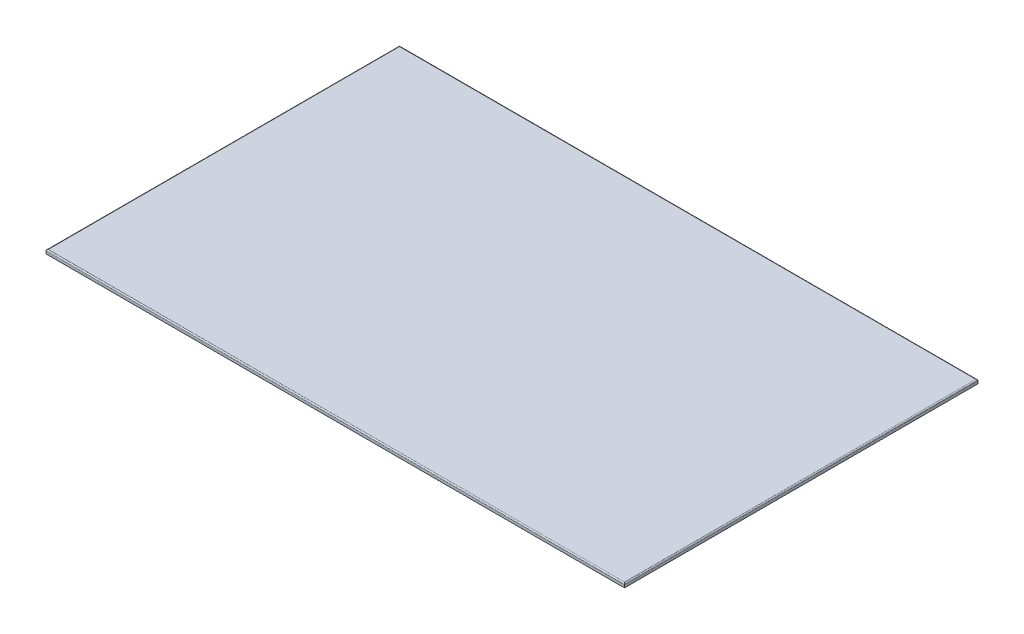
ISO-10303-21;
HEADER;
FILE_DESCRIPTION(('STEP AP214'),'2;1');
FILE_NAME('part.step','',(''),(''),'','','');
FILE_SCHEMA(('AUTOMOTIVE_DESIGN { 1 0 10303 214 1 1 1 1 }'));
ENDSEC;
DATA;
#1=APPLICATION_CONTEXT('core data for automotive mechanical design processes');
#2=APPLICATION_PROTOCOL_DEFINITION('international standard','automotive_design',2000,#1);
#3=PRODUCT_CONTEXT('',#1,'mechanical');
#4=PRODUCT('Part','Part','',(#3));
#5=PRODUCT_RELATED_PRODUCT_CATEGORY('part','',(#4));
#6=PRODUCT_DEFINITION_FORMATION('','',#4);
#7=PRODUCT_DEFINITION_CONTEXT('part definition',#1,'design');
#8=PRODUCT_DEFINITION('design','',#6,#7);
#9=PRODUCT_DEFINITION_SHAPE('','',#8);
#10=(LENGTH_UNIT() NAMED_UNIT(*) SI_UNIT(.MILLI.,.METRE.));
#11=(NAMED_UNIT(*) PLANE_ANGLE_UNIT() SI_UNIT($,.RADIAN.));
#12=(NAMED_UNIT(*) SI_UNIT($,.STERADIAN.) SOLID_ANGLE_UNIT());
#13=UNCERTAINTY_MEASURE_WITH_UNIT(LENGTH_MEASURE(1.E-05),#10,'distance_accuracy_value','');
#14=(GEOMETRIC_REPRESENTATION_CONTEXT(3) GLOBAL_UNCERTAINTY_ASSIGNED_CONTEXT((#13)) GLOBAL_UNIT_ASSIGNED_CONTEXT((#10,
#11,#12)) REPRESENTATION_CONTEXT('',''));
#15=CARTESIAN_POINT('',(0.,0.,0.));
#16=DIRECTION('',(0.,0.,1.));
#17=DIRECTION('',(1.,0.,0.));
#18=AXIS2_PLACEMENT_3D('',#15,#16,#17);
#19=CARTESIAN_POINT('',(450.,6.,275.));
#20=DIRECTION('',(-1.,0.,0.));
#21=DIRECTION('',(0.,0.,1.));
#22=AXIS2_PLACEMENT_3D('',#19,#20,#21);
#23=PLANE('',#22);
#24=DIRECTION('',(0.,-1.,0.));
#25=VECTOR('',#24,1.);
#26=CARTESIAN_POINT('',(450.,6.,-275.));
#27=LINE('',#26,#25);
#28=CARTESIAN_POINT('',(450.,4.25,-275.));
#29=VERTEX_POINT('',#28);
#30=CARTESIAN_POINT('',(450.,0.,-275.));
#31=VERTEX_POINT('',#30);
#32=EDGE_CURVE('E91',#29,#31,#27,.T.);
#33=ORIENTED_EDGE('',*,*,#32,.F.);
#34=DIRECTION('',(0.,0.,-1.));
#35=VECTOR('',#34,1.);
#36=CARTESIAN_POINT('',(450.,4.25,275.));
#37=LINE('',#36,#35);
#38=CARTESIAN_POINT('',(450.,4.25,275.));
#39=VERTEX_POINT('',#38);
#40=EDGE_CURVE('E60',#29,#39,#37,.F.);
#41=ORIENTED_EDGE('',*,*,#40,.T.);
#42=DIRECTION('',(0.,-1.,0.));
#43=VECTOR('',#42,1.);
#44=CARTESIAN_POINT('',(450.,6.,275.));
#45=LINE('',#44,#43);
#46=CARTESIAN_POINT('',(450.,0.,275.));
#47=VERTEX_POINT('',#46);
#48=EDGE_CURVE('E111',#39,#47,#45,.T.);
#49=ORIENTED_EDGE('',*,*,#48,.T.);
#50=DIRECTION('',(0.,0.,-1.));
#51=VECTOR('',#50,1.);
#52=CARTESIAN_POINT('',(450.,0.,275.));
#53=LINE('',#52,#51);
#54=EDGE_CURVE('E107',#47,#31,#53,.T.);
#55=ORIENTED_EDGE('',*,*,#54,.T.);
#56=EDGE_LOOP('',(#33,#41,#49,#55));
#57=FACE_BOUND('',#56,.T.);
#58=ADVANCED_FACE('F37',(#57),#23,.F.);
#59=CARTESIAN_POINT('',(-450.,6.,-275.));
#60=DIRECTION('',(0.,0.,1.));
#61=DIRECTION('',(1.,0.,0.));
#62=AXIS2_PLACEMENT_3D('',#59,#60,#61);
#63=PLANE('',#62);
#64=DIRECTION('',(0.,-1.,0.));
#65=VECTOR('',#64,1.);
#66=CARTESIAN_POINT('',(-450.,6.,-275.));
#67=LINE('',#66,#65);
#68=CARTESIAN_POINT('',(-450.,4.25,-275.));
#69=VERTEX_POINT('',#68);
#70=CARTESIAN_POINT('',(-450.,0.,-275.));
#71=VERTEX_POINT('',#70);
#72=EDGE_CURVE('E101',#69,#71,#67,.T.);
#73=ORIENTED_EDGE('',*,*,#72,.F.);
#74=DIRECTION('',(-1.,0.,0.));
#75=VECTOR('',#74,1.);
#76=CARTESIAN_POINT('',(-450.,4.25,-275.));
#77=LINE('',#76,#75);
#78=EDGE_CURVE('E98',#69,#29,#77,.F.);
#79=ORIENTED_EDGE('',*,*,#78,.T.);
#80=ORIENTED_EDGE('',*,*,#32,.T.);
#81=DIRECTION('',(-1.,0.,0.));
#82=VECTOR('',#81,1.);
#83=CARTESIAN_POINT('',(-450.,0.,-275.));
#84=LINE('',#83,#82);
#85=EDGE_CURVE('E95',#31,#71,#84,.T.);
#86=ORIENTED_EDGE('',*,*,#85,.T.);
#87=EDGE_LOOP('',(#73,#79,#80,#86));
#88=FACE_BOUND('',#87,.T.);
#89=ADVANCED_FACE('F94',(#88),#63,.F.);
#90=CARTESIAN_POINT('',(-450.,6.,275.));
#91=DIRECTION('',(1.,0.,0.));
#92=DIRECTION('',(0.,0.,-1.));
#93=AXIS2_PLACEMENT_3D('',#90,#91,#92);
#94=PLANE('',#93);
#95=DIRECTION('',(0.,-1.,0.));
#96=VECTOR('',#95,1.);
#97=CARTESIAN_POINT('',(-450.,6.,275.));
#98=LINE('',#97,#96);
#99=CARTESIAN_POINT('',(-450.,4.25,275.));
#100=VERTEX_POINT('',#99);
#101=CARTESIAN_POINT('',(-450.,0.,275.));
#102=VERTEX_POINT('',#101);
#103=EDGE_CURVE('E121',#100,#102,#98,.T.);
#104=ORIENTED_EDGE('',*,*,#103,.F.);
#105=DIRECTION('',(0.,0.,1.));
#106=VECTOR('',#105,1.);
#107=CARTESIAN_POINT('',(-450.,4.25,275.));
#108=LINE('',#107,#106);
#109=EDGE_CURVE('E46',#100,#69,#108,.F.);
#110=ORIENTED_EDGE('',*,*,#109,.T.);
#111=ORIENTED_EDGE('',*,*,#72,.T.);
#112=DIRECTION('',(0.,0.,1.));
#113=VECTOR('',#112,1.);
#114=CARTESIAN_POINT('',(-450.,0.,275.));
#115=LINE('',#114,#113);
#116=EDGE_CURVE('E109',#71,#102,#115,.T.);
#117=ORIENTED_EDGE('',*,*,#116,.T.);
#118=EDGE_LOOP('',(#104,#110,#111,#117));
#119=FACE_BOUND('',#118,.T.);
#120=ADVANCED_FACE('F168',(#119),#94,.F.);
#121=CARTESIAN_POINT('',(-450.,6.,275.));
#122=DIRECTION('',(0.,0.,-1.));
#123=DIRECTION('',(-1.,0.,0.));
#124=AXIS2_PLACEMENT_3D('',#121,#122,#123);
#125=PLANE('',#124);
#126=ORIENTED_EDGE('',*,*,#48,.F.);
#127=DIRECTION('',(1.,0.,0.));
#128=VECTOR('',#127,1.);
#129=CARTESIAN_POINT('',(-450.,4.25,275.));
#130=LINE('',#129,#128);
#131=EDGE_CURVE('E11',#39,#100,#130,.F.);
#132=ORIENTED_EDGE('',*,*,#131,.T.);
#133=ORIENTED_EDGE('',*,*,#103,.T.);
#134=DIRECTION('',(1.,0.,0.));
#135=VECTOR('',#134,1.);
#136=CARTESIAN_POINT('',(-450.,0.,275.));
#137=LINE('',#136,#135);
#138=EDGE_CURVE('E118',#102,#47,#137,.T.);
#139=ORIENTED_EDGE('',*,*,#138,.T.);
#140=EDGE_LOOP('',(#126,#132,#133,#139));
#141=FACE_BOUND('',#140,.T.);
#142=ADVANCED_FACE('F200',(#141),#125,.F.);
#143=CARTESIAN_POINT('',(0.,6.,0.));
#144=DIRECTION('',(0.,-1.,0.));
#145=DIRECTION('',(0.,0.,-1.));
#146=AXIS2_PLACEMENT_3D('',#143,#144,#145);
#147=PLANE('',#146);
#148=DIRECTION('',(0.,0.,-1.));
#149=VECTOR('',#148,1.);
#150=CARTESIAN_POINT('',(448.25,6.,0.));
#151=LINE('',#150,#149);
#152=CARTESIAN_POINT('',(448.25,6.,273.25));
#153=VERTEX_POINT('',#152);
#154=CARTESIAN_POINT('',(448.25,6.,-273.25));
#155=VERTEX_POINT('',#154);
#156=EDGE_CURVE('E127',#153,#155,#151,.T.);
#157=ORIENTED_EDGE('',*,*,#156,.T.);
#158=DIRECTION('',(-1.,0.,0.));
#159=VECTOR('',#158,1.);
#160=CARTESIAN_POINT('',(0.,6.,-273.25));
#161=LINE('',#160,#159);
#162=CARTESIAN_POINT('',(-448.25,6.,-273.25));
#163=VERTEX_POINT('',#162);
#164=EDGE_CURVE('E129',#155,#163,#161,.T.);
#165=ORIENTED_EDGE('',*,*,#164,.T.);
#166=DIRECTION('',(0.,0.,1.));
#167=VECTOR('',#166,1.);
#168=CARTESIAN_POINT('',(-448.25,6.,0.));
#169=LINE('',#168,#167);
#170=CARTESIAN_POINT('',(-448.25,6.,273.25));
#171=VERTEX_POINT('',#170);
#172=EDGE_CURVE('E125',#163,#171,#169,.T.);
#173=ORIENTED_EDGE('',*,*,#172,.T.);
#174=DIRECTION('',(1.,0.,0.));
#175=VECTOR('',#174,1.);
#176=CARTESIAN_POINT('',(0.,6.,273.25));
#177=LINE('',#176,#175);
#178=EDGE_CURVE('E100',#171,#153,#177,.T.);
#179=ORIENTED_EDGE('',*,*,#178,.T.);
#180=EDGE_LOOP('',(#157,#165,#173,#179));
#181=FACE_BOUND('',#180,.T.);
#182=ADVANCED_FACE('F150',(#181),#147,.F.);
#183=CARTESIAN_POINT('',(0.,0.,0.));
#184=DIRECTION('',(0.,-1.,0.));
#185=DIRECTION('',(0.,0.,-1.));
#186=AXIS2_PLACEMENT_3D('',#183,#184,#185);
#187=PLANE('',#186);
#188=ORIENTED_EDGE('',*,*,#54,.F.);
#189=ORIENTED_EDGE('',*,*,#138,.F.);
#190=ORIENTED_EDGE('',*,*,#116,.F.);
#191=ORIENTED_EDGE('',*,*,#85,.F.);
#192=EDGE_LOOP('',(#188,#189,#190,#191));
#193=FACE_BOUND('',#192,.T.);
#194=ADVANCED_FACE('F105',(#193),#187,.T.);
#195=CARTESIAN_POINT('',(0.,4.25,273.25));
#196=DIRECTION('',(1.,0.,0.));
#197=DIRECTION('',(0.,0.,-1.));
#198=AXIS2_PLACEMENT_3D('',#195,#196,#197);
#199=CYLINDRICAL_SURFACE('',#198,1.75);
#200=CARTESIAN_POINT('',(-448.25,4.25,273.25));
#201=DIRECTION('',(0.707106781186547,0.,0.707106781186547));
#202=DIRECTION('',(0.707106781186547,0.,-0.707106781186547));
#203=AXIS2_PLACEMENT_3D('',#200,#201,#202);
#204=ELLIPSE('',#203,2.47487373415292,1.75);
#205=EDGE_CURVE('E115',#100,#171,#204,.F.);
#206=ORIENTED_EDGE('',*,*,#205,.F.);
#207=ORIENTED_EDGE('',*,*,#131,.F.);
#208=CARTESIAN_POINT('',(448.25,4.25,273.25));
#209=DIRECTION('',(0.707106781186547,0.,-0.707106781186547));
#210=DIRECTION('',(0.707106781186547,0.,0.707106781186547));
#211=AXIS2_PLACEMENT_3D('',#208,#209,#210);
#212=ELLIPSE('',#211,2.47487373415292,1.75);
#213=EDGE_CURVE('E41',#153,#39,#212,.T.);
#214=ORIENTED_EDGE('',*,*,#213,.F.);
#215=ORIENTED_EDGE('',*,*,#178,.F.);
#216=EDGE_LOOP('',(#206,#207,#214,#215));
#217=FACE_BOUND('',#216,.T.);
#218=ADVANCED_FACE('F39',(#217),#199,.T.);
#219=CARTESIAN_POINT('',(448.25,4.25,0.));
#220=DIRECTION('',(0.,0.,-1.));
#221=DIRECTION('',(-1.,0.,0.));
#222=AXIS2_PLACEMENT_3D('',#219,#220,#221);
#223=CYLINDRICAL_SURFACE('',#222,1.75);
#224=ORIENTED_EDGE('',*,*,#213,.T.);
#225=ORIENTED_EDGE('',*,*,#40,.F.);
#226=CARTESIAN_POINT('',(448.25,4.25,-273.25));
#227=DIRECTION('',(-0.707106781186547,0.,-0.707106781186547));
#228=DIRECTION('',(0.707106781186547,0.,-0.707106781186547));
#229=AXIS2_PLACEMENT_3D('',#226,#227,#228);
#230=ELLIPSE('',#229,2.47487373415292,1.75);
#231=EDGE_CURVE('E137',#155,#29,#230,.T.);
#232=ORIENTED_EDGE('',*,*,#231,.F.);
#233=ORIENTED_EDGE('',*,*,#156,.F.);
#234=EDGE_LOOP('',(#224,#225,#232,#233));
#235=FACE_BOUND('',#234,.T.);
#236=ADVANCED_FACE('F156',(#235),#223,.T.);
#237=CARTESIAN_POINT('',(-448.25,4.25,0.));
#238=DIRECTION('',(0.,0.,1.));
#239=DIRECTION('',(1.,0.,0.));
#240=AXIS2_PLACEMENT_3D('',#237,#238,#239);
#241=CYLINDRICAL_SURFACE('',#240,1.75);
#242=ORIENTED_EDGE('',*,*,#205,.T.);
#243=ORIENTED_EDGE('',*,*,#172,.F.);
#244=CARTESIAN_POINT('',(-448.25,4.25,-273.25));
#245=DIRECTION('',(-0.707106781186547,0.,0.707106781186547));
#246=DIRECTION('',(0.707106781186547,0.,0.707106781186547));
#247=AXIS2_PLACEMENT_3D('',#244,#245,#246);
#248=ELLIPSE('',#247,2.47487373415292,1.75);
#249=EDGE_CURVE('E135',#69,#163,#248,.F.);
#250=ORIENTED_EDGE('',*,*,#249,.F.);
#251=ORIENTED_EDGE('',*,*,#109,.F.);
#252=EDGE_LOOP('',(#242,#243,#250,#251));
#253=FACE_BOUND('',#252,.T.);
#254=ADVANCED_FACE('F143',(#253),#241,.T.);
#255=CARTESIAN_POINT('',(0.,4.25,-273.25));
#256=DIRECTION('',(-1.,0.,0.));
#257=DIRECTION('',(0.,0.,1.));
#258=AXIS2_PLACEMENT_3D('',#255,#256,#257);
#259=CYLINDRICAL_SURFACE('',#258,1.75);
#260=ORIENTED_EDGE('',*,*,#231,.T.);
#261=ORIENTED_EDGE('',*,*,#78,.F.);
#262=ORIENTED_EDGE('',*,*,#249,.T.);
#263=ORIENTED_EDGE('',*,*,#164,.F.);
#264=EDGE_LOOP('',(#260,#261,#262,#263));
#265=FACE_BOUND('',#264,.T.);
#266=ADVANCED_FACE('F154',(#265),#259,.T.);
#267=CLOSED_SHELL('',(#58,#89,#120,#142,#182,#194,#218,#236,#254,#266));
#268=MANIFOLD_SOLID_BREP('B2',#267);
#269=ADVANCED_BREP_SHAPE_REPRESENTATION('',(#18,#268),#14);
#270=SHAPE_DEFINITION_REPRESENTATION(#9,#269);
ENDSEC;
END-ISO-10303-21;
